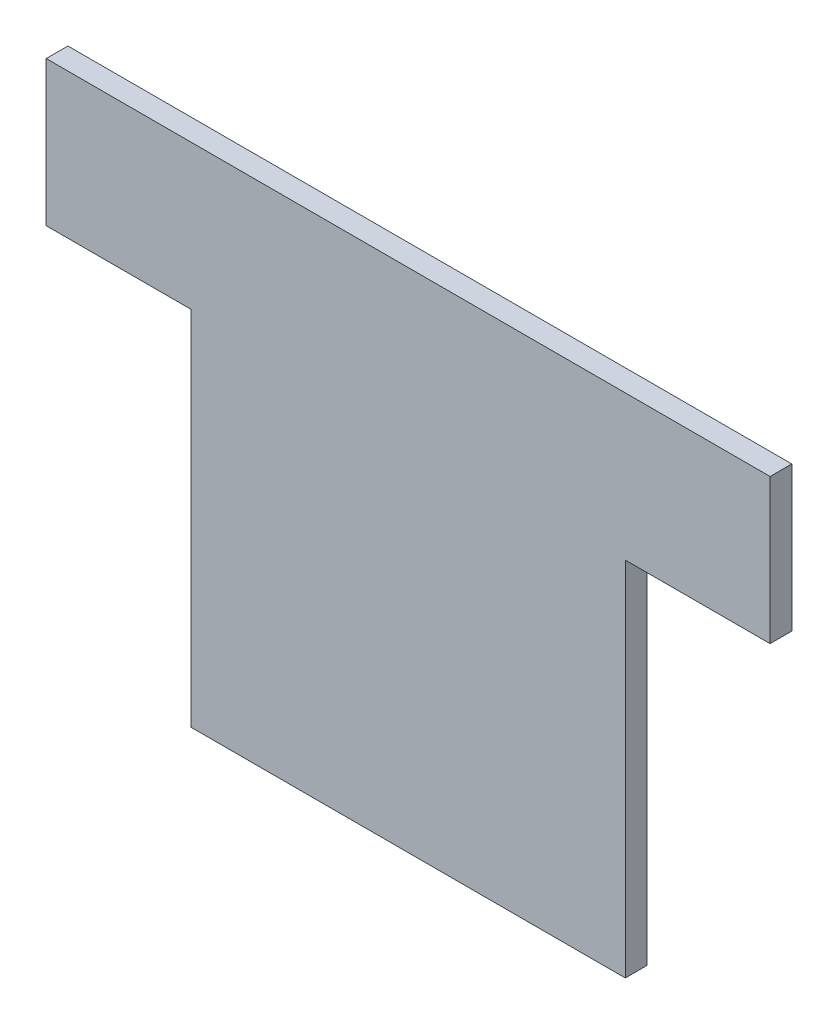
ISO-10303-21;
HEADER;
FILE_DESCRIPTION(('STEP AP214'),'2;1');
FILE_NAME('part.step','',(''),(''),'','','');
FILE_SCHEMA(('AUTOMOTIVE_DESIGN { 1 0 10303 214 1 1 1 1 }'));
ENDSEC;
DATA;
#1=APPLICATION_CONTEXT('core data for automotive mechanical design processes');
#2=APPLICATION_PROTOCOL_DEFINITION('international standard','automotive_design',2000,#1);
#3=PRODUCT_CONTEXT('',#1,'mechanical');
#4=PRODUCT('Part','Part','',(#3));
#5=PRODUCT_RELATED_PRODUCT_CATEGORY('part','',(#4));
#6=PRODUCT_DEFINITION_FORMATION('','',#4);
#7=PRODUCT_DEFINITION_CONTEXT('part definition',#1,'design');
#8=PRODUCT_DEFINITION('design','',#6,#7);
#9=PRODUCT_DEFINITION_SHAPE('','',#8);
#10=(LENGTH_UNIT() NAMED_UNIT(*) SI_UNIT(.MILLI.,.METRE.));
#11=(NAMED_UNIT(*) PLANE_ANGLE_UNIT() SI_UNIT($,.RADIAN.));
#12=(NAMED_UNIT(*) SI_UNIT($,.STERADIAN.) SOLID_ANGLE_UNIT());
#13=UNCERTAINTY_MEASURE_WITH_UNIT(LENGTH_MEASURE(1.E-05),#10,'distance_accuracy_value','');
#14=(GEOMETRIC_REPRESENTATION_CONTEXT(3) GLOBAL_UNCERTAINTY_ASSIGNED_CONTEXT((#13)) GLOBAL_UNIT_ASSIGNED_CONTEXT((#10,
#11,#12)) REPRESENTATION_CONTEXT('',''));
#15=CARTESIAN_POINT('',(0.,0.,0.));
#16=DIRECTION('',(0.,0.,1.));
#17=DIRECTION('',(1.,0.,0.));
#18=AXIS2_PLACEMENT_3D('',#15,#16,#17);
#19=CARTESIAN_POINT('',(-50.,-20.,3.));
#20=DIRECTION('',(0.,1.,0.));
#21=DIRECTION('',(0.,0.,1.));
#22=AXIS2_PLACEMENT_3D('',#19,#20,#21);
#23=PLANE('',#22);
#24=DIRECTION('',(1.,0.,0.));
#25=VECTOR('',#24,1.);
#26=CARTESIAN_POINT('',(-50.,-20.,0.));
#27=LINE('',#26,#25);
#28=CARTESIAN_POINT('',(-50.,-20.,0.));
#29=VERTEX_POINT('',#28);
#30=CARTESIAN_POINT('',(-30.,-20.,0.));
#31=VERTEX_POINT('',#30);
#32=EDGE_CURVE('E132',#29,#31,#27,.T.);
#33=ORIENTED_EDGE('',*,*,#32,.T.);
#34=DIRECTION('',(0.,0.,-1.));
#35=VECTOR('',#34,1.);
#36=CARTESIAN_POINT('',(-30.,-20.,3.));
#37=LINE('',#36,#35);
#38=CARTESIAN_POINT('',(-30.,-20.,3.));
#39=VERTEX_POINT('',#38);
#40=EDGE_CURVE('E11',#39,#31,#37,.T.);
#41=ORIENTED_EDGE('',*,*,#40,.F.);
#42=DIRECTION('',(1.,0.,0.));
#43=VECTOR('',#42,1.);
#44=CARTESIAN_POINT('',(-50.,-20.,3.));
#45=LINE('',#44,#43);
#46=CARTESIAN_POINT('',(-50.,-20.,3.));
#47=VERTEX_POINT('',#46);
#48=EDGE_CURVE('E146',#47,#39,#45,.T.);
#49=ORIENTED_EDGE('',*,*,#48,.F.);
#50=DIRECTION('',(0.,0.,-1.));
#51=VECTOR('',#50,1.);
#52=CARTESIAN_POINT('',(-50.,-20.,3.));
#53=LINE('',#52,#51);
#54=EDGE_CURVE('E128',#47,#29,#53,.T.);
#55=ORIENTED_EDGE('',*,*,#54,.T.);
#56=EDGE_LOOP('',(#33,#41,#49,#55));
#57=FACE_BOUND('',#56,.T.);
#58=ADVANCED_FACE('F36',(#57),#23,.F.);
#59=CARTESIAN_POINT('',(-30.,-20.,3.));
#60=DIRECTION('',(1.,0.,0.));
#61=DIRECTION('',(0.,0.,-1.));
#62=AXIS2_PLACEMENT_3D('',#59,#60,#61);
#63=PLANE('',#62);
#64=DIRECTION('',(0.,-1.,0.));
#65=VECTOR('',#64,1.);
#66=CARTESIAN_POINT('',(-30.,-20.,0.));
#67=LINE('',#66,#65);
#68=CARTESIAN_POINT('',(-30.,-70.,0.));
#69=VERTEX_POINT('',#68);
#70=EDGE_CURVE('E135',#31,#69,#67,.T.);
#71=ORIENTED_EDGE('',*,*,#70,.T.);
#72=DIRECTION('',(0.,0.,-1.));
#73=VECTOR('',#72,1.);
#74=CARTESIAN_POINT('',(-30.,-70.,3.));
#75=LINE('',#74,#73);
#76=CARTESIAN_POINT('',(-30.,-70.,3.));
#77=VERTEX_POINT('',#76);
#78=EDGE_CURVE('E44',#77,#69,#75,.T.);
#79=ORIENTED_EDGE('',*,*,#78,.F.);
#80=DIRECTION('',(0.,-1.,0.));
#81=VECTOR('',#80,1.);
#82=CARTESIAN_POINT('',(-30.,-20.,3.));
#83=LINE('',#82,#81);
#84=EDGE_CURVE('E95',#39,#77,#83,.T.);
#85=ORIENTED_EDGE('',*,*,#84,.F.);
#86=ORIENTED_EDGE('',*,*,#40,.T.);
#87=EDGE_LOOP('',(#71,#79,#85,#86));
#88=FACE_BOUND('',#87,.T.);
#89=ADVANCED_FACE('F181',(#88),#63,.F.);
#90=CARTESIAN_POINT('',(-30.,-70.,3.));
#91=DIRECTION('',(0.,1.,0.));
#92=DIRECTION('',(0.,0.,1.));
#93=AXIS2_PLACEMENT_3D('',#90,#91,#92);
#94=PLANE('',#93);
#95=DIRECTION('',(1.,0.,0.));
#96=VECTOR('',#95,1.);
#97=CARTESIAN_POINT('',(-30.,-70.,0.));
#98=LINE('',#97,#96);
#99=CARTESIAN_POINT('',(30.,-70.,0.));
#100=VERTEX_POINT('',#99);
#101=EDGE_CURVE('E137',#69,#100,#98,.T.);
#102=ORIENTED_EDGE('',*,*,#101,.T.);
#103=DIRECTION('',(0.,0.,-1.));
#104=VECTOR('',#103,1.);
#105=CARTESIAN_POINT('',(30.,-70.,3.));
#106=LINE('',#105,#104);
#107=CARTESIAN_POINT('',(30.,-70.,3.));
#108=VERTEX_POINT('',#107);
#109=EDGE_CURVE('E153',#108,#100,#106,.T.);
#110=ORIENTED_EDGE('',*,*,#109,.F.);
#111=DIRECTION('',(1.,0.,0.));
#112=VECTOR('',#111,1.);
#113=CARTESIAN_POINT('',(-30.,-70.,3.));
#114=LINE('',#113,#112);
#115=EDGE_CURVE('E161',#77,#108,#114,.T.);
#116=ORIENTED_EDGE('',*,*,#115,.F.);
#117=ORIENTED_EDGE('',*,*,#78,.T.);
#118=EDGE_LOOP('',(#102,#110,#116,#117));
#119=FACE_BOUND('',#118,.T.);
#120=ADVANCED_FACE('F159',(#119),#94,.F.);
#121=CARTESIAN_POINT('',(30.,-70.,3.));
#122=DIRECTION('',(-1.,0.,0.));
#123=DIRECTION('',(0.,0.,1.));
#124=AXIS2_PLACEMENT_3D('',#121,#122,#123);
#125=PLANE('',#124);
#126=DIRECTION('',(0.,1.,0.));
#127=VECTOR('',#126,1.);
#128=CARTESIAN_POINT('',(30.,-70.,0.));
#129=LINE('',#128,#127);
#130=CARTESIAN_POINT('',(30.,-20.,0.));
#131=VERTEX_POINT('',#130);
#132=EDGE_CURVE('E139',#100,#131,#129,.T.);
#133=ORIENTED_EDGE('',*,*,#132,.T.);
#134=DIRECTION('',(0.,0.,-1.));
#135=VECTOR('',#134,1.);
#136=CARTESIAN_POINT('',(30.,-20.,3.));
#137=LINE('',#136,#135);
#138=CARTESIAN_POINT('',(30.,-20.,3.));
#139=VERTEX_POINT('',#138);
#140=EDGE_CURVE('E150',#139,#131,#137,.T.);
#141=ORIENTED_EDGE('',*,*,#140,.F.);
#142=DIRECTION('',(0.,1.,0.));
#143=VECTOR('',#142,1.);
#144=CARTESIAN_POINT('',(30.,-70.,3.));
#145=LINE('',#144,#143);
#146=EDGE_CURVE('E173',#108,#139,#145,.T.);
#147=ORIENTED_EDGE('',*,*,#146,.F.);
#148=ORIENTED_EDGE('',*,*,#109,.T.);
#149=EDGE_LOOP('',(#133,#141,#147,#148));
#150=FACE_BOUND('',#149,.T.);
#151=ADVANCED_FACE('F169',(#150),#125,.F.);
#152=CARTESIAN_POINT('',(30.,-20.,3.));
#153=DIRECTION('',(0.,1.,0.));
#154=DIRECTION('',(-1.,0.,0.));
#155=AXIS2_PLACEMENT_3D('',#152,#153,#154);
#156=PLANE('',#155);
#157=DIRECTION('',(1.,0.,0.));
#158=VECTOR('',#157,1.);
#159=CARTESIAN_POINT('',(30.,-20.,0.));
#160=LINE('',#159,#158);
#161=CARTESIAN_POINT('',(50.,-20.,0.));
#162=VERTEX_POINT('',#161);
#163=EDGE_CURVE('E141',#131,#162,#160,.T.);
#164=ORIENTED_EDGE('',*,*,#163,.T.);
#165=DIRECTION('',(0.,0.,-1.));
#166=VECTOR('',#165,1.);
#167=CARTESIAN_POINT('',(50.,-20.,3.));
#168=LINE('',#167,#166);
#169=CARTESIAN_POINT('',(50.,-20.,3.));
#170=VERTEX_POINT('',#169);
#171=EDGE_CURVE('E123',#170,#162,#168,.T.);
#172=ORIENTED_EDGE('',*,*,#171,.F.);
#173=DIRECTION('',(1.,0.,0.));
#174=VECTOR('',#173,1.);
#175=CARTESIAN_POINT('',(30.,-20.,3.));
#176=LINE('',#175,#174);
#177=EDGE_CURVE('E114',#139,#170,#176,.T.);
#178=ORIENTED_EDGE('',*,*,#177,.F.);
#179=ORIENTED_EDGE('',*,*,#140,.T.);
#180=EDGE_LOOP('',(#164,#172,#178,#179));
#181=FACE_BOUND('',#180,.T.);
#182=ADVANCED_FACE('F172',(#181),#156,.F.);
#183=CARTESIAN_POINT('',(50.,-20.,3.));
#184=DIRECTION('',(-1.,0.,0.));
#185=DIRECTION('',(0.,-1.,0.));
#186=AXIS2_PLACEMENT_3D('',#183,#184,#185);
#187=PLANE('',#186);
#188=DIRECTION('',(0.,1.,0.));
#189=VECTOR('',#188,1.);
#190=CARTESIAN_POINT('',(50.,-20.,0.));
#191=LINE('',#190,#189);
#192=CARTESIAN_POINT('',(50.,0.,0.));
#193=VERTEX_POINT('',#192);
#194=EDGE_CURVE('E122',#162,#193,#191,.T.);
#195=ORIENTED_EDGE('',*,*,#194,.T.);
#196=DIRECTION('',(0.,0.,-1.));
#197=VECTOR('',#196,1.);
#198=CARTESIAN_POINT('',(50.,0.,3.));
#199=LINE('',#198,#197);
#200=CARTESIAN_POINT('',(50.,0.,3.));
#201=VERTEX_POINT('',#200);
#202=EDGE_CURVE('E119',#201,#193,#199,.T.);
#203=ORIENTED_EDGE('',*,*,#202,.F.);
#204=DIRECTION('',(0.,1.,0.));
#205=VECTOR('',#204,1.);
#206=CARTESIAN_POINT('',(50.,-20.,3.));
#207=LINE('',#206,#205);
#208=EDGE_CURVE('E108',#170,#201,#207,.T.);
#209=ORIENTED_EDGE('',*,*,#208,.F.);
#210=ORIENTED_EDGE('',*,*,#171,.T.);
#211=EDGE_LOOP('',(#195,#203,#209,#210));
#212=FACE_BOUND('',#211,.T.);
#213=ADVANCED_FACE('F120',(#212),#187,.F.);
#214=CARTESIAN_POINT('',(50.,0.,3.));
#215=DIRECTION('',(0.,-1.,0.));
#216=DIRECTION('',(1.,0.,0.));
#217=AXIS2_PLACEMENT_3D('',#214,#215,#216);
#218=PLANE('',#217);
#219=DIRECTION('',(-1.,0.,0.));
#220=VECTOR('',#219,1.);
#221=CARTESIAN_POINT('',(50.,0.,0.));
#222=LINE('',#221,#220);
#223=CARTESIAN_POINT('',(-50.,0.,0.));
#224=VERTEX_POINT('',#223);
#225=EDGE_CURVE('E81',#193,#224,#222,.T.);
#226=ORIENTED_EDGE('',*,*,#225,.T.);
#227=DIRECTION('',(0.,0.,-1.));
#228=VECTOR('',#227,1.);
#229=CARTESIAN_POINT('',(-50.,0.,3.));
#230=LINE('',#229,#228);
#231=CARTESIAN_POINT('',(-50.,0.,3.));
#232=VERTEX_POINT('',#231);
#233=EDGE_CURVE('E124',#232,#224,#230,.T.);
#234=ORIENTED_EDGE('',*,*,#233,.F.);
#235=DIRECTION('',(-1.,0.,0.));
#236=VECTOR('',#235,1.);
#237=CARTESIAN_POINT('',(50.,0.,3.));
#238=LINE('',#237,#236);
#239=EDGE_CURVE('E112',#201,#232,#238,.T.);
#240=ORIENTED_EDGE('',*,*,#239,.F.);
#241=ORIENTED_EDGE('',*,*,#202,.T.);
#242=EDGE_LOOP('',(#226,#234,#240,#241));
#243=FACE_BOUND('',#242,.T.);
#244=ADVANCED_FACE('F126',(#243),#218,.F.);
#245=CARTESIAN_POINT('',(-50.,0.,3.));
#246=DIRECTION('',(1.,0.,0.));
#247=DIRECTION('',(0.,1.,0.));
#248=AXIS2_PLACEMENT_3D('',#245,#246,#247);
#249=PLANE('',#248);
#250=DIRECTION('',(0.,-1.,0.));
#251=VECTOR('',#250,1.);
#252=CARTESIAN_POINT('',(-50.,0.,0.));
#253=LINE('',#252,#251);
#254=EDGE_CURVE('E87',#224,#29,#253,.T.);
#255=ORIENTED_EDGE('',*,*,#254,.T.);
#256=ORIENTED_EDGE('',*,*,#54,.F.);
#257=DIRECTION('',(0.,-1.,0.));
#258=VECTOR('',#257,1.);
#259=CARTESIAN_POINT('',(-50.,0.,3.));
#260=LINE('',#259,#258);
#261=EDGE_CURVE('E52',#232,#47,#260,.T.);
#262=ORIENTED_EDGE('',*,*,#261,.F.);
#263=ORIENTED_EDGE('',*,*,#233,.T.);
#264=EDGE_LOOP('',(#255,#256,#262,#263));
#265=FACE_BOUND('',#264,.T.);
#266=ADVANCED_FACE('F197',(#265),#249,.F.);
#267=CARTESIAN_POINT('',(0.,0.,3.));
#268=DIRECTION('',(0.,0.,-1.));
#269=DIRECTION('',(-1.,0.,0.));
#270=AXIS2_PLACEMENT_3D('',#267,#268,#269);
#271=PLANE('',#270);
#272=ORIENTED_EDGE('',*,*,#48,.T.);
#273=ORIENTED_EDGE('',*,*,#84,.T.);
#274=ORIENTED_EDGE('',*,*,#115,.T.);
#275=ORIENTED_EDGE('',*,*,#146,.T.);
#276=ORIENTED_EDGE('',*,*,#177,.T.);
#277=ORIENTED_EDGE('',*,*,#208,.T.);
#278=ORIENTED_EDGE('',*,*,#239,.T.);
#279=ORIENTED_EDGE('',*,*,#261,.T.);
#280=EDGE_LOOP('',(#272,#273,#274,#275,#276,#277,#278,#279));
#281=FACE_BOUND('',#280,.T.);
#282=ADVANCED_FACE('F110',(#281),#271,.F.);
#283=CARTESIAN_POINT('',(0.,0.,0.));
#284=DIRECTION('',(0.,0.,-1.));
#285=DIRECTION('',(-1.,0.,0.));
#286=AXIS2_PLACEMENT_3D('',#283,#284,#285);
#287=PLANE('',#286);
#288=ORIENTED_EDGE('',*,*,#32,.F.);
#289=ORIENTED_EDGE('',*,*,#254,.F.);
#290=ORIENTED_EDGE('',*,*,#225,.F.);
#291=ORIENTED_EDGE('',*,*,#194,.F.);
#292=ORIENTED_EDGE('',*,*,#163,.F.);
#293=ORIENTED_EDGE('',*,*,#132,.F.);
#294=ORIENTED_EDGE('',*,*,#101,.F.);
#295=ORIENTED_EDGE('',*,*,#70,.F.);
#296=EDGE_LOOP('',(#288,#289,#290,#291,#292,#293,#294,#295));
#297=FACE_BOUND('',#296,.T.);
#298=ADVANCED_FACE('F165',(#297),#287,.T.);
#299=CLOSED_SHELL('',(#58,#89,#120,#151,#182,#213,#244,#266,#282,#298));
#300=MANIFOLD_SOLID_BREP('B2',#299);
#301=ADVANCED_BREP_SHAPE_REPRESENTATION('',(#18,#300),#14);
#302=SHAPE_DEFINITION_REPRESENTATION(#9,#301);
ENDSEC;
END-ISO-10303-21;
